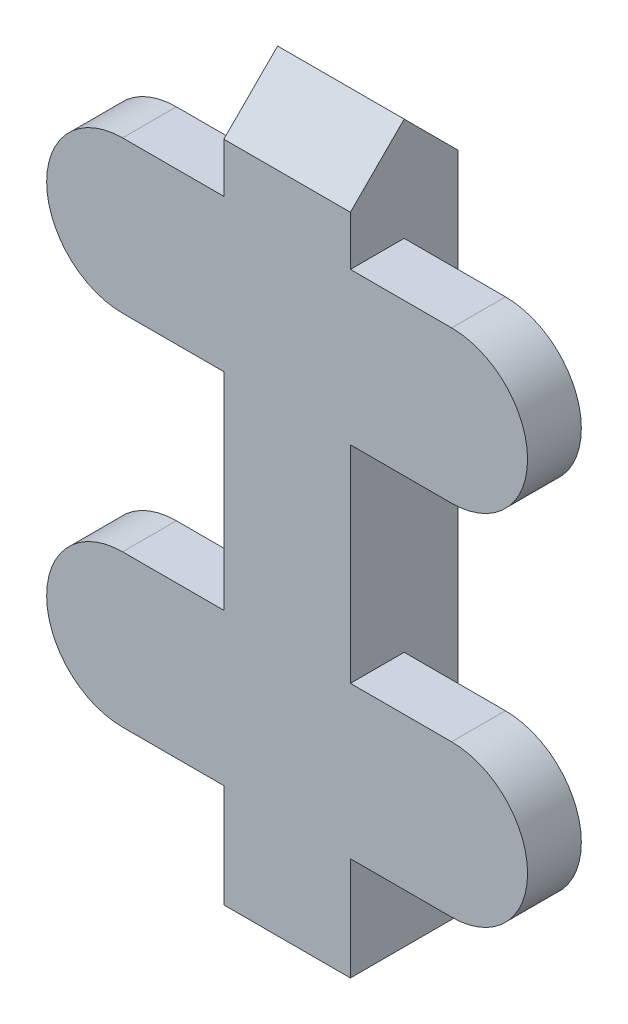
ISO-10303-21;
HEADER;
FILE_DESCRIPTION(('STEP AP214'),'2;1');
FILE_NAME('part.step','',(''),(''),'','','');
FILE_SCHEMA(('AUTOMOTIVE_DESIGN { 1 0 10303 214 1 1 1 1 }'));
ENDSEC;
DATA;
#1=APPLICATION_CONTEXT('core data for automotive mechanical design processes');
#2=APPLICATION_PROTOCOL_DEFINITION('international standard','automotive_design',2000,#1);
#3=PRODUCT_CONTEXT('',#1,'mechanical');
#4=PRODUCT('Part','Part','',(#3));
#5=PRODUCT_RELATED_PRODUCT_CATEGORY('part','',(#4));
#6=PRODUCT_DEFINITION_FORMATION('','',#4);
#7=PRODUCT_DEFINITION_CONTEXT('part definition',#1,'design');
#8=PRODUCT_DEFINITION('design','',#6,#7);
#9=PRODUCT_DEFINITION_SHAPE('','',#8);
#10=(LENGTH_UNIT() NAMED_UNIT(*) SI_UNIT(.MILLI.,.METRE.));
#11=(NAMED_UNIT(*) PLANE_ANGLE_UNIT() SI_UNIT($,.RADIAN.));
#12=(NAMED_UNIT(*) SI_UNIT($,.STERADIAN.) SOLID_ANGLE_UNIT());
#13=UNCERTAINTY_MEASURE_WITH_UNIT(LENGTH_MEASURE(1.E-05),#10,'distance_accuracy_value','');
#14=(GEOMETRIC_REPRESENTATION_CONTEXT(3) GLOBAL_UNCERTAINTY_ASSIGNED_CONTEXT((#13)) GLOBAL_UNIT_ASSIGNED_CONTEXT((#10,
#11,#12)) REPRESENTATION_CONTEXT('',''));
#15=CARTESIAN_POINT('',(0.,0.,0.));
#16=DIRECTION('',(0.,0.,1.));
#17=DIRECTION('',(1.,0.,0.));
#18=AXIS2_PLACEMENT_3D('',#15,#16,#17);
#19=CARTESIAN_POINT('',(2.5,1.67432918768527,-5.));
#20=DIRECTION('',(1.,0.,0.));
#21=DIRECTION('',(0.,0.,-1.));
#22=AXIS2_PLACEMENT_3D('',#19,#20,#21);
#23=PLANE('',#22);
#24=DIRECTION('',(0.,-1.,0.));
#25=VECTOR('',#24,1.);
#26=CARTESIAN_POINT('',(2.5,0.,2.125));
#27=LINE('',#26,#25);
#28=CARTESIAN_POINT('',(2.5,5.75574689076395,2.125));
#29=VERTEX_POINT('',#28);
#30=CARTESIAN_POINT('',(2.5,1.67432918768527,2.125));
#31=VERTEX_POINT('',#30);
#32=EDGE_CURVE('E348',#29,#31,#27,.T.);
#33=ORIENTED_EDGE('',*,*,#32,.T.);
#34=DIRECTION('',(0.,0.,1.));
#35=VECTOR('',#34,1.);
#36=CARTESIAN_POINT('',(2.5,1.67432918768527,-5.));
#37=LINE('',#36,#35);
#38=CARTESIAN_POINT('',(2.5,1.67432918768527,-2.125));
#39=VERTEX_POINT('',#38);
#40=EDGE_CURVE('E334',#39,#31,#37,.T.);
#41=ORIENTED_EDGE('',*,*,#40,.F.);
#42=DIRECTION('',(0.,-1.,0.));
#43=VECTOR('',#42,1.);
#44=CARTESIAN_POINT('',(2.5,0.,-2.125));
#45=LINE('',#44,#43);
#46=CARTESIAN_POINT('',(2.5,27.875,-2.125));
#47=VERTEX_POINT('',#46);
#48=EDGE_CURVE('E345',#47,#39,#45,.T.);
#49=ORIENTED_EDGE('',*,*,#48,.F.);
#50=DIRECTION('',(0.,-0.707106781186548,-0.707106781186547));
#51=VECTOR('',#50,1.);
#52=CARTESIAN_POINT('',(2.5,30.,0.));
#53=LINE('',#52,#51);
#54=CARTESIAN_POINT('',(2.5,30.,0.));
#55=VERTEX_POINT('',#54);
#56=EDGE_CURVE('E370',#55,#47,#53,.T.);
#57=ORIENTED_EDGE('',*,*,#56,.F.);
#58=DIRECTION('',(0.,-0.707106781186547,0.707106781186548));
#59=VECTOR('',#58,1.);
#60=CARTESIAN_POINT('',(2.5,27.875,2.125));
#61=LINE('',#60,#59);
#62=CARTESIAN_POINT('',(2.5,27.875,2.125));
#63=VERTEX_POINT('',#62);
#64=EDGE_CURVE('E338',#63,#55,#61,.F.);
#65=ORIENTED_EDGE('',*,*,#64,.F.);
#66=CARTESIAN_POINT('',(2.5,25.9185822969213,2.125));
#67=VERTEX_POINT('',#66);
#68=EDGE_CURVE('E349',#63,#67,#27,.T.);
#69=ORIENTED_EDGE('',*,*,#68,.T.);
#70=DIRECTION('',(0.,0.,1.));
#71=VECTOR('',#70,1.);
#72=CARTESIAN_POINT('',(2.5,25.9185822969213,-5.));
#73=LINE('',#72,#71);
#74=CARTESIAN_POINT('',(2.5,25.9185822969213,0.));
#75=VERTEX_POINT('',#74);
#76=EDGE_CURVE('E380',#75,#67,#73,.T.);
#77=ORIENTED_EDGE('',*,*,#76,.F.);
#78=DIRECTION('',(0.,-1.,0.));
#79=VECTOR('',#78,1.);
#80=CARTESIAN_POINT('',(2.5,0.,0.));
#81=LINE('',#80,#79);
#82=CARTESIAN_POINT('',(2.5,19.9185822969213,0.));
#83=VERTEX_POINT('',#82);
#84=EDGE_CURVE('E293',#75,#83,#81,.T.);
#85=ORIENTED_EDGE('',*,*,#84,.T.);
#86=DIRECTION('',(0.,0.,1.));
#87=VECTOR('',#86,1.);
#88=CARTESIAN_POINT('',(2.5,19.9185822969213,-5.));
#89=LINE('',#88,#87);
#90=CARTESIAN_POINT('',(2.5,19.9185822969213,2.125));
#91=VERTEX_POINT('',#90);
#92=EDGE_CURVE('E383',#83,#91,#89,.T.);
#93=ORIENTED_EDGE('',*,*,#92,.T.);
#94=CARTESIAN_POINT('',(2.5,11.7557468907639,2.125));
#95=VERTEX_POINT('',#94);
#96=EDGE_CURVE('E354',#91,#95,#27,.T.);
#97=ORIENTED_EDGE('',*,*,#96,.T.);
#98=DIRECTION('',(0.,0.,1.));
#99=VECTOR('',#98,1.);
#100=CARTESIAN_POINT('',(2.5,11.7557468907639,0.));
#101=LINE('',#100,#99);
#102=CARTESIAN_POINT('',(2.5,11.7557468907639,0.));
#103=VERTEX_POINT('',#102);
#104=EDGE_CURVE('E274',#103,#95,#101,.T.);
#105=ORIENTED_EDGE('',*,*,#104,.F.);
#106=DIRECTION('',(0.,-1.,0.));
#107=VECTOR('',#106,1.);
#108=CARTESIAN_POINT('',(2.5,0.,0.));
#109=LINE('',#108,#107);
#110=CARTESIAN_POINT('',(2.5,5.75574689076395,0.));
#111=VERTEX_POINT('',#110);
#112=EDGE_CURVE('E265',#103,#111,#109,.T.);
#113=ORIENTED_EDGE('',*,*,#112,.T.);
#114=DIRECTION('',(0.,0.,1.));
#115=VECTOR('',#114,1.);
#116=CARTESIAN_POINT('',(2.5,5.75574689076395,0.));
#117=LINE('',#116,#115);
#118=EDGE_CURVE('E270',#111,#29,#117,.T.);
#119=ORIENTED_EDGE('',*,*,#118,.T.);
#120=EDGE_LOOP('',(#33,#41,#49,#57,#65,#69,#77,#85,#93,#97,#105,#113,#119));
#121=FACE_BOUND('',#120,.T.);
#122=ADVANCED_FACE('F47',(#121),#23,.T.);
#123=CARTESIAN_POINT('',(2.5,1.67432918768527,-5.));
#124=DIRECTION('',(0.,-1.,0.));
#125=DIRECTION('',(1.,0.,0.));
#126=AXIS2_PLACEMENT_3D('',#123,#124,#125);
#127=PLANE('',#126);
#128=DIRECTION('',(-1.,0.,0.));
#129=VECTOR('',#128,1.);
#130=CARTESIAN_POINT('',(0.,1.67432918768527,2.125));
#131=LINE('',#130,#129);
#132=CARTESIAN_POINT('',(-2.5,1.67432918768527,2.125));
#133=VERTEX_POINT('',#132);
#134=EDGE_CURVE('E366',#31,#133,#131,.T.);
#135=ORIENTED_EDGE('',*,*,#134,.T.);
#136=DIRECTION('',(0.,0.,1.));
#137=VECTOR('',#136,1.);
#138=CARTESIAN_POINT('',(-2.5,1.67432918768527,-5.));
#139=LINE('',#138,#137);
#140=CARTESIAN_POINT('',(-2.5,1.67432918768527,-2.125));
#141=VERTEX_POINT('',#140);
#142=EDGE_CURVE('E333',#141,#133,#139,.T.);
#143=ORIENTED_EDGE('',*,*,#142,.F.);
#144=DIRECTION('',(-1.,0.,0.));
#145=VECTOR('',#144,1.);
#146=CARTESIAN_POINT('',(0.,1.67432918768527,-2.125));
#147=LINE('',#146,#145);
#148=EDGE_CURVE('E65',#39,#141,#147,.T.);
#149=ORIENTED_EDGE('',*,*,#148,.F.);
#150=ORIENTED_EDGE('',*,*,#40,.T.);
#151=EDGE_LOOP('',(#135,#143,#149,#150));
#152=FACE_BOUND('',#151,.T.);
#153=ADVANCED_FACE('F487',(#152),#127,.T.);
#154=CARTESIAN_POINT('',(-2.5,1.67432918768527,-5.));
#155=DIRECTION('',(-1.,0.,0.));
#156=DIRECTION('',(0.,0.,1.));
#157=AXIS2_PLACEMENT_3D('',#154,#155,#156);
#158=PLANE('',#157);
#159=DIRECTION('',(0.,1.,0.));
#160=VECTOR('',#159,1.);
#161=CARTESIAN_POINT('',(-2.5,0.,0.));
#162=LINE('',#161,#160);
#163=CARTESIAN_POINT('',(-2.5,19.9185822969213,0.));
#164=VERTEX_POINT('',#163);
#165=CARTESIAN_POINT('',(-2.5,25.9185822969213,0.));
#166=VERTEX_POINT('',#165);
#167=EDGE_CURVE('E241',#164,#166,#162,.T.);
#168=ORIENTED_EDGE('',*,*,#167,.T.);
#169=DIRECTION('',(0.,0.,1.));
#170=VECTOR('',#169,1.);
#171=CARTESIAN_POINT('',(-2.5,25.9185822969213,-5.));
#172=LINE('',#171,#170);
#173=CARTESIAN_POINT('',(-2.5,25.9185822969213,2.125));
#174=VERTEX_POINT('',#173);
#175=EDGE_CURVE('E386',#166,#174,#172,.T.);
#176=ORIENTED_EDGE('',*,*,#175,.T.);
#177=DIRECTION('',(0.,1.,0.));
#178=VECTOR('',#177,1.);
#179=CARTESIAN_POINT('',(-2.5,0.,2.125));
#180=LINE('',#179,#178);
#181=CARTESIAN_POINT('',(-2.5,27.875,2.125));
#182=VERTEX_POINT('',#181);
#183=EDGE_CURVE('E361',#174,#182,#180,.T.);
#184=ORIENTED_EDGE('',*,*,#183,.T.);
#185=DIRECTION('',(0.,0.707106781186547,-0.707106781186548));
#186=VECTOR('',#185,1.);
#187=CARTESIAN_POINT('',(-2.5,27.875,2.125));
#188=LINE('',#187,#186);
#189=CARTESIAN_POINT('',(-2.5,30.,0.));
#190=VERTEX_POINT('',#189);
#191=EDGE_CURVE('E353',#190,#182,#188,.F.);
#192=ORIENTED_EDGE('',*,*,#191,.F.);
#193=DIRECTION('',(0.,0.707106781186548,0.707106781186547));
#194=VECTOR('',#193,1.);
#195=CARTESIAN_POINT('',(-2.5,30.,0.));
#196=LINE('',#195,#194);
#197=CARTESIAN_POINT('',(-2.5,27.875,-2.125));
#198=VERTEX_POINT('',#197);
#199=EDGE_CURVE('E374',#198,#190,#196,.T.);
#200=ORIENTED_EDGE('',*,*,#199,.F.);
#201=DIRECTION('',(0.,1.,0.));
#202=VECTOR('',#201,1.);
#203=CARTESIAN_POINT('',(-2.5,0.,-2.125));
#204=LINE('',#203,#202);
#205=EDGE_CURVE('E358',#141,#198,#204,.T.);
#206=ORIENTED_EDGE('',*,*,#205,.F.);
#207=ORIENTED_EDGE('',*,*,#142,.T.);
#208=CARTESIAN_POINT('',(-2.5,5.75574689076395,2.125));
#209=VERTEX_POINT('',#208);
#210=EDGE_CURVE('E362',#133,#209,#180,.T.);
#211=ORIENTED_EDGE('',*,*,#210,.T.);
#212=DIRECTION('',(0.,0.,1.));
#213=VECTOR('',#212,1.);
#214=CARTESIAN_POINT('',(-2.5,5.75574689076395,0.));
#215=LINE('',#214,#213);
#216=CARTESIAN_POINT('',(-2.5,5.75574689076395,0.));
#217=VERTEX_POINT('',#216);
#218=EDGE_CURVE('E215',#217,#209,#215,.T.);
#219=ORIENTED_EDGE('',*,*,#218,.F.);
#220=DIRECTION('',(0.,1.,0.));
#221=VECTOR('',#220,1.);
#222=CARTESIAN_POINT('',(-2.5,0.,0.));
#223=LINE('',#222,#221);
#224=CARTESIAN_POINT('',(-2.5,11.7557468907639,0.));
#225=VERTEX_POINT('',#224);
#226=EDGE_CURVE('E201',#217,#225,#223,.T.);
#227=ORIENTED_EDGE('',*,*,#226,.T.);
#228=DIRECTION('',(0.,0.,1.));
#229=VECTOR('',#228,1.);
#230=CARTESIAN_POINT('',(-2.5,11.7557468907639,0.));
#231=LINE('',#230,#229);
#232=CARTESIAN_POINT('',(-2.5,11.7557468907639,2.125));
#233=VERTEX_POINT('',#232);
#234=EDGE_CURVE('E231',#225,#233,#231,.T.);
#235=ORIENTED_EDGE('',*,*,#234,.T.);
#236=CARTESIAN_POINT('',(-2.5,19.9185822969213,2.125));
#237=VERTEX_POINT('',#236);
#238=EDGE_CURVE('E367',#233,#237,#180,.T.);
#239=ORIENTED_EDGE('',*,*,#238,.T.);
#240=DIRECTION('',(0.,0.,1.));
#241=VECTOR('',#240,1.);
#242=CARTESIAN_POINT('',(-2.5,19.9185822969213,-5.));
#243=LINE('',#242,#241);
#244=EDGE_CURVE('E389',#164,#237,#243,.T.);
#245=ORIENTED_EDGE('',*,*,#244,.F.);
#246=EDGE_LOOP('',(#168,#176,#184,#192,#200,#206,#207,#211,#219,#227,#235,#239,#245));
#247=FACE_BOUND('',#246,.T.);
#248=ADVANCED_FACE('F462',(#247),#158,.T.);
#249=CARTESIAN_POINT('',(6.5,22.9185822969213,5.));
#250=DIRECTION('',(0.,0.,-1.));
#251=DIRECTION('',(-1.,0.,0.));
#252=AXIS2_PLACEMENT_3D('',#249,#250,#251);
#253=CYLINDRICAL_SURFACE('',#252,3.);
#254=CARTESIAN_POINT('',(6.5,22.9185822969213,2.125));
#255=DIRECTION('',(0.,0.,-1.));
#256=DIRECTION('',(-1.,0.,0.));
#257=AXIS2_PLACEMENT_3D('',#254,#255,#256);
#258=CIRCLE('',#257,3.);
#259=CARTESIAN_POINT('',(6.5,19.9185822969213,2.125));
#260=VERTEX_POINT('',#259);
#261=CARTESIAN_POINT('',(6.5,25.9185822969213,2.125));
#262=VERTEX_POINT('',#261);
#263=EDGE_CURVE('E392',#260,#262,#258,.F.);
#264=ORIENTED_EDGE('',*,*,#263,.F.);
#265=DIRECTION('',(0.,0.,-1.));
#266=VECTOR('',#265,1.);
#267=CARTESIAN_POINT('',(6.5,19.9185822969213,5.));
#268=LINE('',#267,#266);
#269=CARTESIAN_POINT('',(6.5,19.9185822969213,0.));
#270=VERTEX_POINT('',#269);
#271=EDGE_CURVE('E300',#260,#270,#268,.T.);
#272=ORIENTED_EDGE('',*,*,#271,.T.);
#273=CARTESIAN_POINT('',(6.5,22.9185822969213,0.));
#274=DIRECTION('',(0.,0.,1.));
#275=DIRECTION('',(1.,0.,0.));
#276=AXIS2_PLACEMENT_3D('',#273,#274,#275);
#277=CIRCLE('',#276,3.);
#278=CARTESIAN_POINT('',(6.5,25.9185822969213,0.));
#279=VERTEX_POINT('',#278);
#280=EDGE_CURVE('E285',#270,#279,#277,.T.);
#281=ORIENTED_EDGE('',*,*,#280,.T.);
#282=DIRECTION('',(0.,0.,-1.));
#283=VECTOR('',#282,1.);
#284=CARTESIAN_POINT('',(6.5,25.9185822969213,5.));
#285=LINE('',#284,#283);
#286=EDGE_CURVE('E297',#262,#279,#285,.T.);
#287=ORIENTED_EDGE('',*,*,#286,.F.);
#288=EDGE_LOOP('',(#264,#272,#281,#287));
#289=FACE_BOUND('',#288,.T.);
#290=ADVANCED_FACE('F498',(#289),#253,.T.);
#291=CARTESIAN_POINT('',(0.,19.9185822969213,5.));
#292=DIRECTION('',(0.,1.,0.));
#293=DIRECTION('',(0.,0.,1.));
#294=AXIS2_PLACEMENT_3D('',#291,#292,#293);
#295=PLANE('',#294);
#296=DIRECTION('',(1.,0.,0.));
#297=VECTOR('',#296,1.);
#298=CARTESIAN_POINT('',(0.,19.9185822969213,2.125));
#299=LINE('',#298,#297);
#300=EDGE_CURVE('E307',#91,#260,#299,.T.);
#301=ORIENTED_EDGE('',*,*,#300,.F.);
#302=ORIENTED_EDGE('',*,*,#92,.F.);
#303=DIRECTION('',(1.,0.,0.));
#304=VECTOR('',#303,1.);
#305=CARTESIAN_POINT('',(0.,19.9185822969213,0.));
#306=LINE('',#305,#304);
#307=EDGE_CURVE('E273',#83,#270,#306,.T.);
#308=ORIENTED_EDGE('',*,*,#307,.T.);
#309=ORIENTED_EDGE('',*,*,#271,.F.);
#310=EDGE_LOOP('',(#301,#302,#308,#309));
#311=FACE_BOUND('',#310,.T.);
#312=ADVANCED_FACE('F434',(#311),#295,.F.);
#313=CARTESIAN_POINT('',(0.,25.9185822969213,5.));
#314=DIRECTION('',(0.,1.,0.));
#315=DIRECTION('',(0.,0.,1.));
#316=AXIS2_PLACEMENT_3D('',#313,#314,#315);
#317=PLANE('',#316);
#318=ORIENTED_EDGE('',*,*,#76,.T.);
#319=DIRECTION('',(1.,0.,0.));
#320=VECTOR('',#319,1.);
#321=CARTESIAN_POINT('',(0.,25.9185822969213,2.125));
#322=LINE('',#321,#320);
#323=EDGE_CURVE('E303',#67,#262,#322,.T.);
#324=ORIENTED_EDGE('',*,*,#323,.T.);
#325=ORIENTED_EDGE('',*,*,#286,.T.);
#326=DIRECTION('',(1.,0.,0.));
#327=VECTOR('',#326,1.);
#328=CARTESIAN_POINT('',(0.,25.9185822969213,0.));
#329=LINE('',#328,#327);
#330=EDGE_CURVE('E289',#75,#279,#329,.T.);
#331=ORIENTED_EDGE('',*,*,#330,.F.);
#332=EDGE_LOOP('',(#318,#324,#325,#331));
#333=FACE_BOUND('',#332,.T.);
#334=ADVANCED_FACE('F426',(#333),#317,.T.);
#335=CARTESIAN_POINT('',(0.,0.,0.));
#336=DIRECTION('',(0.,0.,1.));
#337=DIRECTION('',(1.,0.,0.));
#338=AXIS2_PLACEMENT_3D('',#335,#336,#337);
#339=PLANE('',#338);
#340=ORIENTED_EDGE('',*,*,#307,.F.);
#341=ORIENTED_EDGE('',*,*,#84,.F.);
#342=ORIENTED_EDGE('',*,*,#330,.T.);
#343=ORIENTED_EDGE('',*,*,#280,.F.);
#344=EDGE_LOOP('',(#340,#341,#342,#343));
#345=FACE_BOUND('',#344,.T.);
#346=ADVANCED_FACE('F430',(#345),#339,.F.);
#347=CARTESIAN_POINT('',(6.5,8.75574689076395,0.));
#348=DIRECTION('',(0.,0.,1.));
#349=DIRECTION('',(1.,0.,0.));
#350=AXIS2_PLACEMENT_3D('',#347,#348,#349);
#351=CYLINDRICAL_SURFACE('',#350,3.);
#352=DIRECTION('',(0.,0.,1.));
#353=VECTOR('',#352,1.);
#354=CARTESIAN_POINT('',(6.5,11.7557468907639,0.));
#355=LINE('',#354,#353);
#356=CARTESIAN_POINT('',(6.5,11.7557468907639,0.));
#357=VERTEX_POINT('',#356);
#358=CARTESIAN_POINT('',(6.5,11.7557468907639,2.125));
#359=VERTEX_POINT('',#358);
#360=EDGE_CURVE('E277',#357,#359,#355,.T.);
#361=ORIENTED_EDGE('',*,*,#360,.T.);
#362=CARTESIAN_POINT('',(6.5,8.75574689076395,2.125));
#363=DIRECTION('',(0.,0.,-1.));
#364=DIRECTION('',(-1.,0.,0.));
#365=AXIS2_PLACEMENT_3D('',#362,#363,#364);
#366=CIRCLE('',#365,3.);
#367=CARTESIAN_POINT('',(6.5,5.75574689076395,2.125));
#368=VERTEX_POINT('',#367);
#369=EDGE_CURVE('E399',#359,#368,#366,.T.);
#370=ORIENTED_EDGE('',*,*,#369,.T.);
#371=DIRECTION('',(0.,0.,1.));
#372=VECTOR('',#371,1.);
#373=CARTESIAN_POINT('',(6.5,5.75574689076395,0.));
#374=LINE('',#373,#372);
#375=CARTESIAN_POINT('',(6.5,5.75574689076395,0.));
#376=VERTEX_POINT('',#375);
#377=EDGE_CURVE('E269',#376,#368,#374,.T.);
#378=ORIENTED_EDGE('',*,*,#377,.F.);
#379=CARTESIAN_POINT('',(6.5,8.75574689076395,0.));
#380=DIRECTION('',(0.,0.,1.));
#381=DIRECTION('',(1.,0.,0.));
#382=AXIS2_PLACEMENT_3D('',#379,#380,#381);
#383=CIRCLE('',#382,3.);
#384=EDGE_CURVE('E258',#376,#357,#383,.T.);
#385=ORIENTED_EDGE('',*,*,#384,.T.);
#386=EDGE_LOOP('',(#361,#370,#378,#385));
#387=FACE_BOUND('',#386,.T.);
#388=ADVANCED_FACE('F511',(#387),#351,.T.);
#389=CARTESIAN_POINT('',(0.,5.75574689076395,0.));
#390=DIRECTION('',(0.,-1.,0.));
#391=DIRECTION('',(0.,0.,-1.));
#392=AXIS2_PLACEMENT_3D('',#389,#390,#391);
#393=PLANE('',#392);
#394=ORIENTED_EDGE('',*,*,#377,.T.);
#395=DIRECTION('',(-1.,0.,0.));
#396=VECTOR('',#395,1.);
#397=CARTESIAN_POINT('',(0.,5.75574689076395,2.125));
#398=LINE('',#397,#396);
#399=EDGE_CURVE('E315',#368,#29,#398,.T.);
#400=ORIENTED_EDGE('',*,*,#399,.T.);
#401=ORIENTED_EDGE('',*,*,#118,.F.);
#402=DIRECTION('',(1.,0.,0.));
#403=VECTOR('',#402,1.);
#404=CARTESIAN_POINT('',(0.,5.75574689076395,0.));
#405=LINE('',#404,#403);
#406=EDGE_CURVE('E254',#111,#376,#405,.T.);
#407=ORIENTED_EDGE('',*,*,#406,.T.);
#408=EDGE_LOOP('',(#394,#400,#401,#407));
#409=FACE_BOUND('',#408,.T.);
#410=ADVANCED_FACE('F451',(#409),#393,.T.);
#411=CARTESIAN_POINT('',(0.,11.7557468907639,0.));
#412=DIRECTION('',(0.,-1.,0.));
#413=DIRECTION('',(0.,0.,-1.));
#414=AXIS2_PLACEMENT_3D('',#411,#412,#413);
#415=PLANE('',#414);
#416=DIRECTION('',(-1.,0.,0.));
#417=VECTOR('',#416,1.);
#418=CARTESIAN_POINT('',(0.,11.7557468907639,2.125));
#419=LINE('',#418,#417);
#420=EDGE_CURVE('E311',#359,#95,#419,.T.);
#421=ORIENTED_EDGE('',*,*,#420,.F.);
#422=ORIENTED_EDGE('',*,*,#360,.F.);
#423=DIRECTION('',(1.,0.,0.));
#424=VECTOR('',#423,1.);
#425=CARTESIAN_POINT('',(0.,11.7557468907639,0.));
#426=LINE('',#425,#424);
#427=EDGE_CURVE('E262',#103,#357,#426,.T.);
#428=ORIENTED_EDGE('',*,*,#427,.F.);
#429=ORIENTED_EDGE('',*,*,#104,.T.);
#430=EDGE_LOOP('',(#421,#422,#428,#429));
#431=FACE_BOUND('',#430,.T.);
#432=ADVANCED_FACE('F445',(#431),#415,.F.);
#433=CARTESIAN_POINT('',(0.,0.,0.));
#434=DIRECTION('',(0.,0.,1.));
#435=DIRECTION('',(1.,0.,0.));
#436=AXIS2_PLACEMENT_3D('',#433,#434,#435);
#437=PLANE('',#436);
#438=ORIENTED_EDGE('',*,*,#406,.F.);
#439=ORIENTED_EDGE('',*,*,#112,.F.);
#440=ORIENTED_EDGE('',*,*,#427,.T.);
#441=ORIENTED_EDGE('',*,*,#384,.F.);
#442=EDGE_LOOP('',(#438,#439,#440,#441));
#443=FACE_BOUND('',#442,.T.);
#444=ADVANCED_FACE('F448',(#443),#437,.F.);
#445=CARTESIAN_POINT('',(-6.5,8.75574689076395,0.));
#446=DIRECTION('',(0.,0.,1.));
#447=DIRECTION('',(1.,0.,0.));
#448=AXIS2_PLACEMENT_3D('',#445,#446,#447);
#449=CYLINDRICAL_SURFACE('',#448,3.);
#450=CARTESIAN_POINT('',(-6.5,8.75574689076395,2.125));
#451=DIRECTION('',(0.,0.,-1.));
#452=DIRECTION('',(-1.,0.,0.));
#453=AXIS2_PLACEMENT_3D('',#450,#451,#452);
#454=CIRCLE('',#453,3.);
#455=CARTESIAN_POINT('',(-6.5,11.7557468907639,2.125));
#456=VERTEX_POINT('',#455);
#457=CARTESIAN_POINT('',(-6.5,5.75574689076395,2.125));
#458=VERTEX_POINT('',#457);
#459=EDGE_CURVE('E396',#456,#458,#454,.F.);
#460=ORIENTED_EDGE('',*,*,#459,.F.);
#461=DIRECTION('',(0.,0.,1.));
#462=VECTOR('',#461,1.);
#463=CARTESIAN_POINT('',(-6.5,11.7557468907639,0.));
#464=LINE('',#463,#462);
#465=CARTESIAN_POINT('',(-6.5,11.7557468907639,0.));
#466=VERTEX_POINT('',#465);
#467=EDGE_CURVE('E219',#466,#456,#464,.T.);
#468=ORIENTED_EDGE('',*,*,#467,.F.);
#469=CARTESIAN_POINT('',(-6.5,8.75574689076395,0.));
#470=DIRECTION('',(0.,0.,1.));
#471=DIRECTION('',(1.,0.,0.));
#472=AXIS2_PLACEMENT_3D('',#469,#470,#471);
#473=CIRCLE('',#472,3.);
#474=CARTESIAN_POINT('',(-6.5,5.75574689076395,0.));
#475=VERTEX_POINT('',#474);
#476=EDGE_CURVE('E199',#475,#466,#473,.F.);
#477=ORIENTED_EDGE('',*,*,#476,.F.);
#478=DIRECTION('',(0.,0.,1.));
#479=VECTOR('',#478,1.);
#480=CARTESIAN_POINT('',(-6.5,5.75574689076395,0.));
#481=LINE('',#480,#479);
#482=EDGE_CURVE('E207',#475,#458,#481,.T.);
#483=ORIENTED_EDGE('',*,*,#482,.T.);
#484=EDGE_LOOP('',(#460,#468,#477,#483));
#485=FACE_BOUND('',#484,.T.);
#486=ADVANCED_FACE('F218',(#485),#449,.T.);
#487=CARTESIAN_POINT('',(0.,11.7557468907639,0.));
#488=DIRECTION('',(0.,1.,0.));
#489=DIRECTION('',(0.,0.,1.));
#490=AXIS2_PLACEMENT_3D('',#487,#488,#489);
#491=PLANE('',#490);
#492=ORIENTED_EDGE('',*,*,#467,.T.);
#493=DIRECTION('',(1.,0.,0.));
#494=VECTOR('',#493,1.);
#495=CARTESIAN_POINT('',(0.,11.7557468907639,2.125));
#496=LINE('',#495,#494);
#497=EDGE_CURVE('E321',#456,#233,#496,.T.);
#498=ORIENTED_EDGE('',*,*,#497,.T.);
#499=ORIENTED_EDGE('',*,*,#234,.F.);
#500=DIRECTION('',(-1.,0.,0.));
#501=VECTOR('',#500,1.);
#502=CARTESIAN_POINT('',(0.,11.7557468907639,0.));
#503=LINE('',#502,#501);
#504=EDGE_CURVE('E216',#225,#466,#503,.T.);
#505=ORIENTED_EDGE('',*,*,#504,.T.);
#506=EDGE_LOOP('',(#492,#498,#499,#505));
#507=FACE_BOUND('',#506,.T.);
#508=ADVANCED_FACE('F531',(#507),#491,.T.);
#509=CARTESIAN_POINT('',(0.,5.75574689076395,0.));
#510=DIRECTION('',(0.,1.,0.));
#511=DIRECTION('',(0.,0.,1.));
#512=AXIS2_PLACEMENT_3D('',#509,#510,#511);
#513=PLANE('',#512);
#514=DIRECTION('',(1.,0.,0.));
#515=VECTOR('',#514,1.);
#516=CARTESIAN_POINT('',(0.,5.75574689076395,2.125));
#517=LINE('',#516,#515);
#518=EDGE_CURVE('E210',#458,#209,#517,.T.);
#519=ORIENTED_EDGE('',*,*,#518,.F.);
#520=ORIENTED_EDGE('',*,*,#482,.F.);
#521=DIRECTION('',(-1.,0.,0.));
#522=VECTOR('',#521,1.);
#523=CARTESIAN_POINT('',(0.,5.75574689076395,0.));
#524=LINE('',#523,#522);
#525=EDGE_CURVE('E194',#217,#475,#524,.T.);
#526=ORIENTED_EDGE('',*,*,#525,.F.);
#527=ORIENTED_EDGE('',*,*,#218,.T.);
#528=EDGE_LOOP('',(#519,#520,#526,#527));
#529=FACE_BOUND('',#528,.T.);
#530=ADVANCED_FACE('F208',(#529),#513,.F.);
#531=CARTESIAN_POINT('',(0.,0.,0.));
#532=DIRECTION('',(0.,0.,1.));
#533=DIRECTION('',(1.,0.,0.));
#534=AXIS2_PLACEMENT_3D('',#531,#532,#533);
#535=PLANE('',#534);
#536=ORIENTED_EDGE('',*,*,#476,.T.);
#537=ORIENTED_EDGE('',*,*,#504,.F.);
#538=ORIENTED_EDGE('',*,*,#226,.F.);
#539=ORIENTED_EDGE('',*,*,#525,.T.);
#540=EDGE_LOOP('',(#536,#537,#538,#539));
#541=FACE_BOUND('',#540,.T.);
#542=ADVANCED_FACE('F196',(#541),#535,.F.);
#543=CARTESIAN_POINT('',(-6.5,22.9185822969213,5.));
#544=DIRECTION('',(0.,0.,-1.));
#545=DIRECTION('',(-1.,0.,0.));
#546=AXIS2_PLACEMENT_3D('',#543,#544,#545);
#547=CYLINDRICAL_SURFACE('',#546,3.);
#548=DIRECTION('',(0.,0.,-1.));
#549=VECTOR('',#548,1.);
#550=CARTESIAN_POINT('',(-6.5,19.9185822969213,5.));
#551=LINE('',#550,#549);
#552=CARTESIAN_POINT('',(-6.5,19.9185822969213,2.125));
#553=VERTEX_POINT('',#552);
#554=CARTESIAN_POINT('',(-6.5,19.9185822969213,0.));
#555=VERTEX_POINT('',#554);
#556=EDGE_CURVE('E251',#553,#555,#551,.T.);
#557=ORIENTED_EDGE('',*,*,#556,.F.);
#558=CARTESIAN_POINT('',(-6.5,22.9185822969213,2.125));
#559=DIRECTION('',(0.,0.,-1.));
#560=DIRECTION('',(-1.,0.,0.));
#561=AXIS2_PLACEMENT_3D('',#558,#559,#560);
#562=CIRCLE('',#561,3.);
#563=CARTESIAN_POINT('',(-6.5,25.9185822969213,2.125));
#564=VERTEX_POINT('',#563);
#565=EDGE_CURVE('E403',#553,#564,#562,.T.);
#566=ORIENTED_EDGE('',*,*,#565,.T.);
#567=DIRECTION('',(0.,0.,-1.));
#568=VECTOR('',#567,1.);
#569=CARTESIAN_POINT('',(-6.5,25.9185822969213,5.));
#570=LINE('',#569,#568);
#571=CARTESIAN_POINT('',(-6.5,25.9185822969213,0.));
#572=VERTEX_POINT('',#571);
#573=EDGE_CURVE('E248',#564,#572,#570,.T.);
#574=ORIENTED_EDGE('',*,*,#573,.T.);
#575=CARTESIAN_POINT('',(-6.5,22.9185822969213,0.));
#576=DIRECTION('',(0.,0.,1.));
#577=DIRECTION('',(1.,0.,0.));
#578=AXIS2_PLACEMENT_3D('',#575,#576,#577);
#579=CIRCLE('',#578,3.);
#580=EDGE_CURVE('E230',#555,#572,#579,.F.);
#581=ORIENTED_EDGE('',*,*,#580,.F.);
#582=EDGE_LOOP('',(#557,#566,#574,#581));
#583=FACE_BOUND('',#582,.T.);
#584=ADVANCED_FACE('F473',(#583),#547,.T.);
#585=CARTESIAN_POINT('',(0.,19.9185822969213,5.));
#586=DIRECTION('',(0.,-1.,0.));
#587=DIRECTION('',(0.,0.,-1.));
#588=AXIS2_PLACEMENT_3D('',#585,#586,#587);
#589=PLANE('',#588);
#590=ORIENTED_EDGE('',*,*,#244,.T.);
#591=DIRECTION('',(-1.,0.,0.));
#592=VECTOR('',#591,1.);
#593=CARTESIAN_POINT('',(0.,19.9185822969213,2.125));
#594=LINE('',#593,#592);
#595=EDGE_CURVE('E329',#237,#553,#594,.T.);
#596=ORIENTED_EDGE('',*,*,#595,.T.);
#597=ORIENTED_EDGE('',*,*,#556,.T.);
#598=DIRECTION('',(-1.,0.,0.));
#599=VECTOR('',#598,1.);
#600=CARTESIAN_POINT('',(0.,19.9185822969213,0.));
#601=LINE('',#600,#599);
#602=EDGE_CURVE('E73',#164,#555,#601,.T.);
#603=ORIENTED_EDGE('',*,*,#602,.F.);
#604=EDGE_LOOP('',(#590,#596,#597,#603));
#605=FACE_BOUND('',#604,.T.);
#606=ADVANCED_FACE('F467',(#605),#589,.T.);
#607=CARTESIAN_POINT('',(0.,25.9185822969213,5.));
#608=DIRECTION('',(0.,-1.,0.));
#609=DIRECTION('',(0.,0.,-1.));
#610=AXIS2_PLACEMENT_3D('',#607,#608,#609);
#611=PLANE('',#610);
#612=DIRECTION('',(-1.,0.,0.));
#613=VECTOR('',#612,1.);
#614=CARTESIAN_POINT('',(0.,25.9185822969213,2.125));
#615=LINE('',#614,#613);
#616=EDGE_CURVE('E325',#174,#564,#615,.T.);
#617=ORIENTED_EDGE('',*,*,#616,.F.);
#618=ORIENTED_EDGE('',*,*,#175,.F.);
#619=DIRECTION('',(-1.,0.,0.));
#620=VECTOR('',#619,1.);
#621=CARTESIAN_POINT('',(0.,25.9185822969213,0.));
#622=LINE('',#621,#620);
#623=EDGE_CURVE('E244',#166,#572,#622,.T.);
#624=ORIENTED_EDGE('',*,*,#623,.T.);
#625=ORIENTED_EDGE('',*,*,#573,.F.);
#626=EDGE_LOOP('',(#617,#618,#624,#625));
#627=FACE_BOUND('',#626,.T.);
#628=ADVANCED_FACE('F476',(#627),#611,.F.);
#629=CARTESIAN_POINT('',(0.,0.,0.));
#630=DIRECTION('',(0.,0.,1.));
#631=DIRECTION('',(1.,0.,0.));
#632=AXIS2_PLACEMENT_3D('',#629,#630,#631);
#633=PLANE('',#632);
#634=ORIENTED_EDGE('',*,*,#580,.T.);
#635=ORIENTED_EDGE('',*,*,#623,.F.);
#636=ORIENTED_EDGE('',*,*,#167,.F.);
#637=ORIENTED_EDGE('',*,*,#602,.T.);
#638=EDGE_LOOP('',(#634,#635,#636,#637));
#639=FACE_BOUND('',#638,.T.);
#640=ADVANCED_FACE('F471',(#639),#633,.F.);
#641=CARTESIAN_POINT('',(0.,27.875,2.125));
#642=DIRECTION('',(0.,-0.707106781186548,-0.707106781186547));
#643=DIRECTION('',(-1.,0.,0.));
#644=AXIS2_PLACEMENT_3D('',#641,#642,#643);
#645=PLANE('',#644);
#646=DIRECTION('',(1.,0.,0.));
#647=VECTOR('',#646,1.);
#648=CARTESIAN_POINT('',(-40.,30.,0.));
#649=LINE('',#648,#647);
#650=EDGE_CURVE('E52',#190,#55,#649,.T.);
#651=ORIENTED_EDGE('',*,*,#650,.F.);
#652=ORIENTED_EDGE('',*,*,#191,.T.);
#653=DIRECTION('',(-1.,0.,0.));
#654=VECTOR('',#653,1.);
#655=CARTESIAN_POINT('',(0.,27.875,2.125));
#656=LINE('',#655,#654);
#657=EDGE_CURVE('E11',#63,#182,#656,.T.);
#658=ORIENTED_EDGE('',*,*,#657,.F.);
#659=ORIENTED_EDGE('',*,*,#64,.T.);
#660=EDGE_LOOP('',(#651,#652,#658,#659));
#661=FACE_BOUND('',#660,.T.);
#662=ADVANCED_FACE('F50',(#661),#645,.F.);
#663=CARTESIAN_POINT('',(-40.,30.,0.));
#664=DIRECTION('',(0.,0.707106781186547,-0.707106781186548));
#665=DIRECTION('',(1.,0.,0.));
#666=AXIS2_PLACEMENT_3D('',#663,#664,#665);
#667=PLANE('',#666);
#668=DIRECTION('',(1.,0.,0.));
#669=VECTOR('',#668,1.);
#670=CARTESIAN_POINT('',(40.,27.875,-2.125));
#671=LINE('',#670,#669);
#672=EDGE_CURVE('E58',#198,#47,#671,.T.);
#673=ORIENTED_EDGE('',*,*,#672,.F.);
#674=ORIENTED_EDGE('',*,*,#199,.T.);
#675=ORIENTED_EDGE('',*,*,#650,.T.);
#676=ORIENTED_EDGE('',*,*,#56,.T.);
#677=EDGE_LOOP('',(#673,#674,#675,#676));
#678=FACE_BOUND('',#677,.T.);
#679=ADVANCED_FACE('F414',(#678),#667,.T.);
#680=CARTESIAN_POINT('',(0.,0.,2.125));
#681=DIRECTION('',(0.,0.,-1.));
#682=DIRECTION('',(-1.,0.,0.));
#683=AXIS2_PLACEMENT_3D('',#680,#681,#682);
#684=PLANE('',#683);
#685=ORIENTED_EDGE('',*,*,#68,.F.);
#686=ORIENTED_EDGE('',*,*,#657,.T.);
#687=ORIENTED_EDGE('',*,*,#183,.F.);
#688=ORIENTED_EDGE('',*,*,#616,.T.);
#689=ORIENTED_EDGE('',*,*,#565,.F.);
#690=ORIENTED_EDGE('',*,*,#595,.F.);
#691=ORIENTED_EDGE('',*,*,#238,.F.);
#692=ORIENTED_EDGE('',*,*,#497,.F.);
#693=ORIENTED_EDGE('',*,*,#459,.T.);
#694=ORIENTED_EDGE('',*,*,#518,.T.);
#695=ORIENTED_EDGE('',*,*,#210,.F.);
#696=ORIENTED_EDGE('',*,*,#134,.F.);
#697=ORIENTED_EDGE('',*,*,#32,.F.);
#698=ORIENTED_EDGE('',*,*,#399,.F.);
#699=ORIENTED_EDGE('',*,*,#369,.F.);
#700=ORIENTED_EDGE('',*,*,#420,.T.);
#701=ORIENTED_EDGE('',*,*,#96,.F.);
#702=ORIENTED_EDGE('',*,*,#300,.T.);
#703=ORIENTED_EDGE('',*,*,#263,.T.);
#704=ORIENTED_EDGE('',*,*,#323,.F.);
#705=EDGE_LOOP('',(#685,#686,#687,#688,#689,#690,#691,#692,#693,#694,#695,#696,#697,#698,#699,
#700,#701,#702,#703,#704));
#706=FACE_BOUND('',#705,.T.);
#707=ADVANCED_FACE('F422',(#706),#684,.F.);
#708=CARTESIAN_POINT('',(0.,0.,-2.125));
#709=DIRECTION('',(0.,0.,-1.));
#710=DIRECTION('',(-1.,0.,0.));
#711=AXIS2_PLACEMENT_3D('',#708,#709,#710);
#712=PLANE('',#711);
#713=ORIENTED_EDGE('',*,*,#148,.T.);
#714=ORIENTED_EDGE('',*,*,#205,.T.);
#715=ORIENTED_EDGE('',*,*,#672,.T.);
#716=ORIENTED_EDGE('',*,*,#48,.T.);
#717=EDGE_LOOP('',(#713,#714,#715,#716));
#718=FACE_BOUND('',#717,.T.);
#719=ADVANCED_FACE('F479',(#718),#712,.T.);
#720=CLOSED_SHELL('',(#122,#153,#248,#290,#312,#334,#346,#388,#410,#432,#444,#486,#508,#530,
#542,#584,#606,#628,#640,#662,#679,#707,#719));
#721=MANIFOLD_SOLID_BREP('B2',#720);
#722=ADVANCED_BREP_SHAPE_REPRESENTATION('',(#18,#721),#14);
#723=SHAPE_DEFINITION_REPRESENTATION(#9,#722);
ENDSEC;
END-ISO-10303-21;
